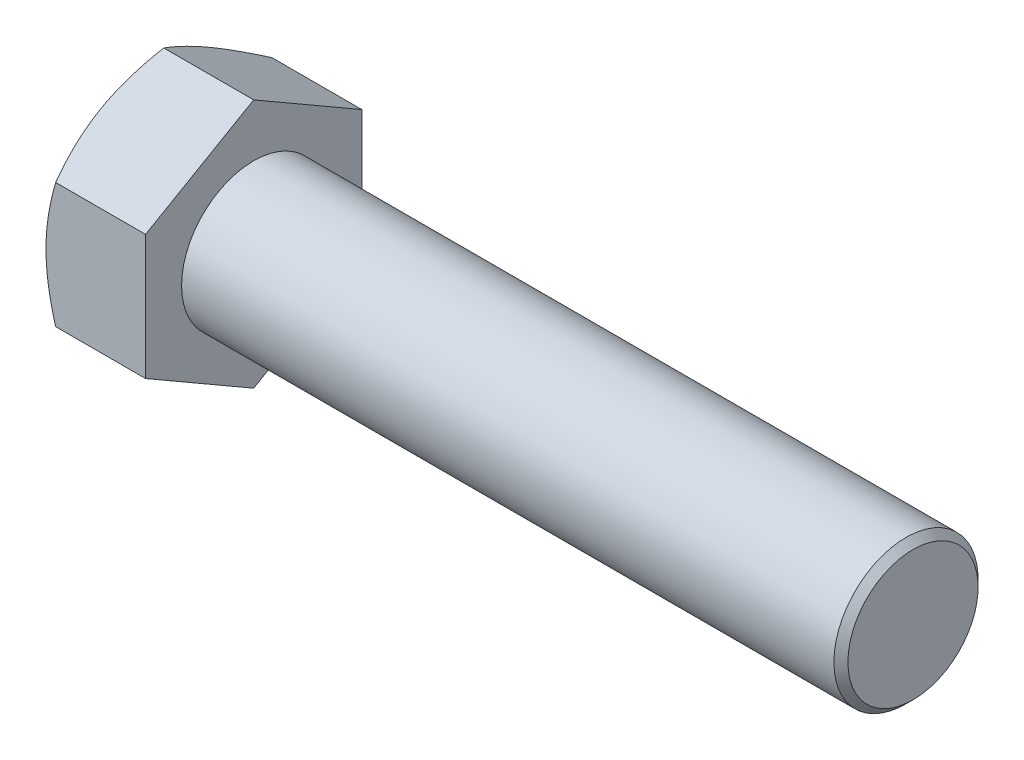
ISO-10303-21;
HEADER;
FILE_DESCRIPTION(('STEP AP214'),'2;1');
FILE_NAME('part.step','',(''),(''),'','','');
FILE_SCHEMA(('AUTOMOTIVE_DESIGN { 1 0 10303 214 1 1 1 1 }'));
ENDSEC;
DATA;
#1=APPLICATION_CONTEXT('core data for automotive mechanical design processes');
#2=APPLICATION_PROTOCOL_DEFINITION('international standard','automotive_design',2000,#1);
#3=PRODUCT_CONTEXT('',#1,'mechanical');
#4=PRODUCT('Part','Part','',(#3));
#5=PRODUCT_RELATED_PRODUCT_CATEGORY('part','',(#4));
#6=PRODUCT_DEFINITION_FORMATION('','',#4);
#7=PRODUCT_DEFINITION_CONTEXT('part definition',#1,'design');
#8=PRODUCT_DEFINITION('design','',#6,#7);
#9=PRODUCT_DEFINITION_SHAPE('','',#8);
#10=(LENGTH_UNIT() NAMED_UNIT(*) SI_UNIT(.MILLI.,.METRE.));
#11=(NAMED_UNIT(*) PLANE_ANGLE_UNIT() SI_UNIT($,.RADIAN.));
#12=(NAMED_UNIT(*) SI_UNIT($,.STERADIAN.) SOLID_ANGLE_UNIT());
#13=UNCERTAINTY_MEASURE_WITH_UNIT(LENGTH_MEASURE(1.E-05),#10,'distance_accuracy_value','');
#14=(GEOMETRIC_REPRESENTATION_CONTEXT(3) GLOBAL_UNCERTAINTY_ASSIGNED_CONTEXT((#13)) GLOBAL_UNIT_ASSIGNED_CONTEXT((#10,
#11,#12)) REPRESENTATION_CONTEXT('',''));
#15=CARTESIAN_POINT('',(0.,0.,0.));
#16=DIRECTION('',(0.,0.,1.));
#17=DIRECTION('',(1.,0.,0.));
#18=AXIS2_PLACEMENT_3D('',#15,#16,#17);
#19=CARTESIAN_POINT('',(15.3416,9.6200411253452,-16.6624));
#20=DIRECTION('',(0.,-0.866025403784438,0.500000000000001));
#21=DIRECTION('',(0.,-0.500000000000001,-0.866025403784438));
#22=AXIS2_PLACEMENT_3D('',#19,#20,#21);
#23=PLANE('',#22);
#24=CARTESIAN_POINT('',(1.48829220858826,19.2401977207443,0.0002));
#25=CARTESIAN_POINT('',(1.36622283895284,19.028753105755,-0.366032816148335));
#26=CARTESIAN_POINT('',(1.24969276885297,18.8164837432287,-0.733694136934186));
#27=CARTESIAN_POINT('',(1.02925095936762,18.3902428689637,-1.4719649874237));
#28=CARTESIAN_POINT('',(0.925343370118908,18.1762708219061,-1.84257544432685));
#29=CARTESIAN_POINT('',(0.731543249344443,17.7462110358046,-2.58746084414686));
#30=CARTESIAN_POINT('',(0.641683878998496,17.53011953331,-2.96174230555155));
#31=CARTESIAN_POINT('',(0.477909771158691,17.0964350034847,-3.71290594566557));
#32=CARTESIAN_POINT('',(0.403994120692871,16.8788420628664,-4.08978797418473));
#33=CARTESIAN_POINT('',(0.275251303949624,16.4477301357542,-4.83649573569204));
#34=CARTESIAN_POINT('',(0.219998022328901,16.2342431550296,-5.20626603306154));
#35=CARTESIAN_POINT('',(0.127350602917071,15.8062909616663,-5.94750097517717));
#36=CARTESIAN_POINT('',(0.0899568088860122,15.5918257302785,-6.31896565239784));
#37=CARTESIAN_POINT('',(0.0339725362796311,15.1625350016603,-7.06251900558288));
#38=CARTESIAN_POINT('',(0.015359713691744,14.9477102378287,-7.43460641126319));
#39=CARTESIAN_POINT('',(-0.00266233524241096,14.517862414981,-8.17912467995825));
#40=CARTESIAN_POINT('',(-0.00207215497260527,14.3028393622975,-8.55155553200468));
#41=CARTESIAN_POINT('',(0.0169707315043864,13.9008482467026,-9.24782456840632));
#42=CARTESIAN_POINT('',(0.0331013278418221,13.7138515430389,-9.57171235999976));
#43=CARTESIAN_POINT('',(0.0795799751792872,13.3403041936295,-10.2187153482096));
#44=CARTESIAN_POINT('',(0.109927822568737,13.1537535415341,-10.5418305558238));
#45=CARTESIAN_POINT('',(0.184313032891822,12.7811757068382,-11.1871542952912));
#46=CARTESIAN_POINT('',(0.228362282492748,12.5951491208412,-11.5093617937966));
#47=CARTESIAN_POINT('',(0.329377054640843,12.223968073547,-12.1522662265168));
#48=CARTESIAN_POINT('',(0.386343455127077,12.0388136724029,-12.4729630565432));
#49=CARTESIAN_POINT('',(0.578058408372527,11.4767672656835,-13.4464559891929));
#50=CARTESIAN_POINT('',(0.73192281293755,11.101502841058,-14.0964330389173));
#51=CARTESIAN_POINT('',(1.08113191708035,10.3565695898289,-15.3866952782936));
#52=CARTESIAN_POINT('',(1.27639460556248,9.98689122584505,-16.0269969871725));
#53=CARTESIAN_POINT('',(1.48829220858825,9.61992565529136,-16.6626));
#54=B_SPLINE_CURVE_WITH_KNOTS('',3,(#24,#25,#26,#27,#28,#29,#30,#31,#32,#33,#34,#35,#36,#37,#38,
#39,#40,#41,#42,#43,#44,#45,#46,#47,#48,#49,#50,#51,#52,#53),.UNSPECIFIED.,.F.,.F.,(4,2,2,2,2,2,
2,2,2,2,2,2,2,2,4),(0.,1.32049889544942,2.64143078841656,3.9654351677652,5.28936371161457,
6.58061480471232,7.87189075085528,9.16162862821639,10.4513266519669,11.5740792758741,
12.6968158209118,13.820529126906,14.9443188311466,17.2413172616423,19.5338071001136),.UNSPECIFIED.);
#55=CARTESIAN_POINT('',(1.48822554132144,19.2400822506905,0.));
#56=VERTEX_POINT('',#55);
#57=CARTESIAN_POINT('',(0.,14.4300616880178,-8.33120000000002));
#58=VERTEX_POINT('',#57);
#59=EDGE_CURVE('E59',#56,#58,#54,.T.);
#60=ORIENTED_EDGE('',*,*,#59,.F.);
#61=DIRECTION('',(-1.,0.,0.));
#62=VECTOR('',#61,1.);
#63=CARTESIAN_POINT('',(15.3416,19.2400822506904,0.));
#64=LINE('',#63,#62);
#65=CARTESIAN_POINT('',(15.3416,19.2400822506904,0.));
#66=VERTEX_POINT('',#65);
#67=EDGE_CURVE('E155',#66,#56,#64,.T.);
#68=ORIENTED_EDGE('',*,*,#67,.F.);
#69=DIRECTION('',(0.,0.500000000000001,0.866025403784438));
#70=VECTOR('',#69,1.);
#71=CARTESIAN_POINT('',(15.3416,9.6200411253452,-16.6624));
#72=LINE('',#71,#70);
#73=CARTESIAN_POINT('',(15.3416,9.6200411253452,-16.6624));
#74=VERTEX_POINT('',#73);
#75=EDGE_CURVE('E246',#74,#66,#72,.T.);
#76=ORIENTED_EDGE('',*,*,#75,.F.);
#77=DIRECTION('',(-1.,0.,0.));
#78=VECTOR('',#77,1.);
#79=CARTESIAN_POINT('',(15.3416,9.6200411253452,-16.6624));
#80=LINE('',#79,#78);
#81=CARTESIAN_POINT('',(1.48822554132143,9.6200411253452,-16.6624));
#82=VERTEX_POINT('',#81);
#83=EDGE_CURVE('E143',#74,#82,#80,.T.);
#84=ORIENTED_EDGE('',*,*,#83,.T.);
#85=EDGE_CURVE('E137',#58,#82,#54,.T.);
#86=ORIENTED_EDGE('',*,*,#85,.F.);
#87=EDGE_LOOP('',(#60,#68,#76,#84,#86));
#88=FACE_BOUND('',#87,.T.);
#89=ADVANCED_FACE('F43',(#88),#23,.F.);
#90=CARTESIAN_POINT('',(15.3416,19.2400822506904,0.));
#91=DIRECTION('',(0.,-0.866025403784438,-0.500000000000001));
#92=DIRECTION('',(0.,0.500000000000001,-0.866025403784438));
#93=AXIS2_PLACEMENT_3D('',#90,#91,#92);
#94=PLANE('',#93);
#95=CARTESIAN_POINT('',(1.48829220858825,9.61992565529137,16.6626));
#96=CARTESIAN_POINT('',(1.36622283895283,9.83137027028069,16.2963671838517));
#97=CARTESIAN_POINT('',(1.24969276885296,10.043639632807,15.9287058630658));
#98=CARTESIAN_POINT('',(1.02925095936761,10.469880507072,15.1904350125763));
#99=CARTESIAN_POINT('',(0.925343370118898,10.6838525541295,14.8198245556731));
#100=CARTESIAN_POINT('',(0.731543249344433,11.113912340231,14.0749391558531));
#101=CARTESIAN_POINT('',(0.641683878998487,11.3300038427257,13.7006576944485));
#102=CARTESIAN_POINT('',(0.477909771158685,11.763688372551,12.9494940543344));
#103=CARTESIAN_POINT('',(0.403994120692867,11.9812813131693,12.5726120258153));
#104=CARTESIAN_POINT('',(0.275251303949621,12.4123932402815,11.825904264308));
#105=CARTESIAN_POINT('',(0.219998022328899,12.6258802210061,11.4561339669385));
#106=CARTESIAN_POINT('',(0.127350602917069,13.0538324143693,10.7148990248228));
#107=CARTESIAN_POINT('',(0.0899568088860101,13.2682976457571,10.3434343476022));
#108=CARTESIAN_POINT('',(0.0339725362796294,13.6975883743753,9.59988099441713));
#109=CARTESIAN_POINT('',(0.0153597136917428,13.9124131382069,9.22779358873681));
#110=CARTESIAN_POINT('',(-0.00266233524241083,14.3422609610546,8.48327532004175));
#111=CARTESIAN_POINT('',(-0.00207215497260427,14.5572840137381,8.11084446799532));
#112=CARTESIAN_POINT('',(0.0169707315043879,14.959275129333,7.41457543159369));
#113=CARTESIAN_POINT('',(0.0331013278418235,15.1462718329967,7.09068764000024));
#114=CARTESIAN_POINT('',(0.0795799751792904,15.5198191824062,6.44368465179042));
#115=CARTESIAN_POINT('',(0.109927822568742,15.7063698345015,6.12056944417618));
#116=CARTESIAN_POINT('',(0.184313032891828,16.0789476691975,5.47524570470877));
#117=CARTESIAN_POINT('',(0.228362282492752,16.2649742551945,5.15303820620345));
#118=CARTESIAN_POINT('',(0.329377054640848,16.6361553024887,4.51013377348319));
#119=CARTESIAN_POINT('',(0.386343455127084,16.8213097036327,4.18943694345679));
#120=CARTESIAN_POINT('',(0.578058408372538,17.3833561103522,3.21594401080714));
#121=CARTESIAN_POINT('',(0.731922812937561,17.7586205349777,2.56596696108265));
#122=CARTESIAN_POINT('',(1.08113191708036,18.5035537862068,1.27570472170637));
#123=CARTESIAN_POINT('',(1.27639460556249,18.8732321501906,0.63540301282747));
#124=CARTESIAN_POINT('',(1.48829220858826,19.2401977207443,-0.000199999999999537));
#125=B_SPLINE_CURVE_WITH_KNOTS('',3,(#95,#96,#97,#98,#99,#100,#101,#102,#103,#104,#105,#106,
#107,#108,#109,#110,#111,#112,#113,#114,#115,#116,#117,#118,#119,#120,#121,#122,#123,#124),
.UNSPECIFIED.,.F.,.F.,(4,2,2,2,2,2,2,2,2,2,2,2,2,2,4),(0.,1.32049889544942,2.64143078841656,
3.9654351677652,5.28936371161457,6.58061480471231,7.87189075085527,9.16162862821638,
10.4513266519669,11.5740792758741,12.6968158209118,13.820529126906,14.9443188311466,
17.2413172616423,19.5338071001136),.UNSPECIFIED.);
#126=CARTESIAN_POINT('',(1.48822554132143,9.62004112534521,16.6624));
#127=VERTEX_POINT('',#126);
#128=CARTESIAN_POINT('',(0.,14.4300616880178,8.33120000000001));
#129=VERTEX_POINT('',#128);
#130=EDGE_CURVE('E66',#127,#129,#125,.T.);
#131=ORIENTED_EDGE('',*,*,#130,.F.);
#132=DIRECTION('',(-1.,0.,0.));
#133=VECTOR('',#132,1.);
#134=CARTESIAN_POINT('',(15.3416,9.62004112534521,16.6624));
#135=LINE('',#134,#133);
#136=CARTESIAN_POINT('',(15.3416,9.62004112534521,16.6624));
#137=VERTEX_POINT('',#136);
#138=EDGE_CURVE('E153',#137,#127,#135,.T.);
#139=ORIENTED_EDGE('',*,*,#138,.F.);
#140=DIRECTION('',(0.,-0.500000000000001,0.866025403784438));
#141=VECTOR('',#140,1.);
#142=CARTESIAN_POINT('',(15.3416,19.2400822506904,0.));
#143=LINE('',#142,#141);
#144=EDGE_CURVE('E244',#66,#137,#143,.T.);
#145=ORIENTED_EDGE('',*,*,#144,.F.);
#146=ORIENTED_EDGE('',*,*,#67,.T.);
#147=EDGE_CURVE('E170',#129,#56,#125,.T.);
#148=ORIENTED_EDGE('',*,*,#147,.F.);
#149=EDGE_LOOP('',(#131,#139,#145,#146,#148));
#150=FACE_BOUND('',#149,.T.);
#151=ADVANCED_FACE('F176',(#150),#94,.F.);
#152=CARTESIAN_POINT('',(15.3416,9.62004112534521,16.6624));
#153=DIRECTION('',(0.,0.,-1.));
#154=DIRECTION('',(0.,1.,0.));
#155=AXIS2_PLACEMENT_3D('',#152,#153,#154);
#156=PLANE('',#155);
#157=CARTESIAN_POINT('',(8.22164509272719,-26.0257896624189,16.6624));
#158=CARTESIAN_POINT('',(8.04434599439993,-25.6611463637942,16.6624));
#159=CARTESIAN_POINT('',(7.86791708374687,-25.2960801557625,16.6624));
#160=CARTESIAN_POINT('',(7.51699635306082,-24.5650137355599,16.6624));
#161=CARTESIAN_POINT('',(7.34250455194592,-24.1990135143101,16.6624));
#162=CARTESIAN_POINT('',(6.82218508705523,-23.0993846259986,16.6624));
#163=CARTESIAN_POINT('',(6.47956456555795,-22.364232758842,16.6624));
#164=CARTESIAN_POINT('',(5.80310742938759,-20.8851581863444,16.6624));
#165=CARTESIAN_POINT('',(5.46932720606579,-20.1412096294622,16.6624));
#166=CARTESIAN_POINT('',(4.81517496228219,-18.6474608856369,16.6624));
#167=CARTESIAN_POINT('',(4.49480232069081,-17.8976609716818,16.6624));
#168=CARTESIAN_POINT('',(3.86067992339217,-16.3660743997116,16.6624));
#169=CARTESIAN_POINT('',(3.54750035780181,-15.584050449172,16.6624));
#170=CARTESIAN_POINT('',(2.94439724196953,-14.0109164551487,16.6624));
#171=CARTESIAN_POINT('',(2.65447627591384,-13.2198054131605,16.6624));
#172=CARTESIAN_POINT('',(2.10537077010853,-11.6286859886654,16.6624));
#173=CARTESIAN_POINT('',(1.84612556761438,-10.8286987079723,16.6624));
#174=CARTESIAN_POINT('',(1.3665524030007,-9.21717443246324,16.6624));
#175=CARTESIAN_POINT('',(1.14621237677199,-8.40564110260778,16.6624));
#176=CARTESIAN_POINT('',(0.853369918651563,-7.1817891142791,16.6624));
#177=CARTESIAN_POINT('',(0.762237563300738,-6.77390240496468,16.6624));
#178=CARTESIAN_POINT('',(0.593594770187671,-5.95530800403371,16.6624));
#179=CARTESIAN_POINT('',(0.51608406177755,-5.54460036863451,16.6624));
#180=CARTESIAN_POINT('',(0.376040960858033,-4.72063291261086,16.6624));
#181=CARTESIAN_POINT('',(0.313508337967318,-4.30737313134183,16.6624));
#182=CARTESIAN_POINT('',(0.204662075321274,-3.47872666025358,16.6624));
#183=CARTESIAN_POINT('',(0.15834772131471,-3.06334006491674,16.6624));
#184=CARTESIAN_POINT('',(0.0834487658941515,-2.23652152670713,16.6624));
#185=CARTESIAN_POINT('',(0.0546369494069092,-1.82511029375207,16.6624));
#186=CARTESIAN_POINT('',(0.014446770887921,-1.00143821029122,16.6624));
#187=CARTESIAN_POINT('',(0.0030681144035693,-0.589177374253321,16.6624));
#188=CARTESIAN_POINT('',(-0.00198430893864704,0.235456351831487,16.6624));
#189=CARTESIAN_POINT('',(0.00434194741196159,0.647829242024569,16.6624));
#190=CARTESIAN_POINT('',(0.0345427779307335,1.47193677270388,16.6624));
#191=CARTESIAN_POINT('',(0.058418135436777,1.88367138387714,16.6624));
#192=CARTESIAN_POINT('',(0.135934690581573,2.86764639176185,16.6624));
#193=CARTESIAN_POINT('',(0.197593524997373,3.43926666294606,16.6624));
#194=CARTESIAN_POINT('',(0.3514214244265,4.57838941858348,16.6624));
#195=CARTESIAN_POINT('',(0.443594484445646,5.14589135390569,16.6624));
#196=CARTESIAN_POINT('',(0.655172226537651,6.27619412275952,16.6624));
#197=CARTESIAN_POINT('',(0.774597586970072,6.83899104835958,16.6624));
#198=CARTESIAN_POINT('',(1.03702522572261,7.95900081485822,16.6624));
#199=CARTESIAN_POINT('',(1.18002719082487,8.51621372983671,16.6624));
#200=CARTESIAN_POINT('',(1.48952817763261,9.63742193800513,16.6624));
#201=CARTESIAN_POINT('',(1.65648011639228,10.2012913331135,16.6624));
#202=CARTESIAN_POINT('',(2.00800777787534,11.3234782484586,16.6624));
#203=CARTESIAN_POINT('',(2.19258361946115,11.8817957312229,16.6624));
#204=CARTESIAN_POINT('',(2.57639583491167,12.9931482252761,16.6624));
#205=CARTESIAN_POINT('',(2.77562758915428,13.5461848395511,16.6624));
#206=CARTESIAN_POINT('',(3.18637114340819,14.6476507035618,16.6624));
#207=CARTESIAN_POINT('',(3.39788278286763,15.1960800134279,16.6624));
#208=CARTESIAN_POINT('',(3.92019877173346,16.5134270037689,16.6624));
#209=CARTESIAN_POINT('',(4.23608462611976,17.2803271386577,16.6624));
#210=CARTESIAN_POINT('',(4.88381068964253,18.8073811238195,16.6624));
#211=CARTESIAN_POINT('',(5.21565199343991,19.5675345069655,16.6624));
#212=CARTESIAN_POINT('',(5.89201922664066,21.0823871055584,16.6624));
#213=CARTESIAN_POINT('',(6.23654827876434,21.8370849228567,16.6624));
#214=CARTESIAN_POINT('',(6.93566827393983,23.3417712615155,16.6624));
#215=CARTESIAN_POINT('',(7.29025897603377,24.0917598951277,16.6624));
#216=CARTESIAN_POINT('',(8.00800184704983,25.5887104314289,16.6624));
#217=CARTESIAN_POINT('',(8.37116362235635,26.3356677197903,16.6624));
#218=CARTESIAN_POINT('',(9.10415281410865,27.8263042460643,16.6624));
#219=CARTESIAN_POINT('',(9.47398026273146,28.5699834681311,16.6624));
#220=CARTESIAN_POINT('',(10.2190827077366,30.0544746991066,16.6624));
#221=CARTESIAN_POINT('',(10.5943569349586,30.7952870944922,16.6624));
#222=CARTESIAN_POINT('',(11.3494923878504,32.2745659615686,16.6624));
#223=CARTESIAN_POINT('',(11.7293536040817,33.0130324380826,16.6624));
#224=CARTESIAN_POINT('',(12.808308339535,35.0972033721326,16.6624));
#225=CARTESIAN_POINT('',(13.5118862286309,36.4405862009893,16.6624));
#226=CARTESIAN_POINT('',(14.9285753043895,39.1223708046942,16.6624));
#227=CARTESIAN_POINT('',(15.6416868636698,40.4607723822242,16.6624));
#228=CARTESIAN_POINT('',(17.0732765934307,43.1301244334298,16.6624));
#229=CARTESIAN_POINT('',(17.7917354812495,44.4610852556436,16.6624));
#230=CARTESIAN_POINT('',(18.8736349552661,46.4551885082581,16.6624));
#231=CARTESIAN_POINT('',(19.2349594482728,47.1194807302153,16.6624));
#232=CARTESIAN_POINT('',(19.9588707067244,48.4473757738426,16.6624));
#233=CARTESIAN_POINT('',(20.3214574702282,49.1109785965709,16.6624));
#234=CARTESIAN_POINT('',(20.6846018054718,49.774276245195,16.6624));
#235=B_SPLINE_CURVE_WITH_KNOTS('',3,(#157,#158,#159,#160,#161,#162,#163,#164,#165,#166,#167,
#168,#169,#170,#171,#172,#173,#174,#175,#176,#177,#178,#179,#180,#181,#182,#183,#184,#185,#186,
#187,#188,#189,#190,#191,#192,#193,#194,#195,#196,#197,#198,#199,#200,#201,#202,#203,#204,#205,
#206,#207,#208,#209,#210,#211,#212,#213,#214,#215,#216,#217,#218,#219,#220,#221,#222,#223,#224,
#225,#226,#227,#228,#229,#230,#231,#232,#233,#234),.UNSPECIFIED.,.F.,.F.,(4,2,2,2,2,2,2,2,2,2,2,
2,2,2,2,2,2,2,2,2,2,2,2,2,2,2,2,2,2,2,2,2,2,2,2,2,2,2,4),(0.,1.21638486168481,2.43278159231982,
4.86592555926723,7.31200680114574,9.75797459832355,12.2849012160502,14.8121082045311,
17.3342309058074,19.8555701430835,21.1092096632871,22.3628242721677,23.6164195976801,
24.8699597080115,26.1068579806328,27.3437353613484,28.5806143634246,29.8175485793269,
31.5414072390945,33.2654916804638,34.9908886894104,36.7162627781094,38.4801173592769,
40.2439838374031,42.0072966982238,43.7705865100158,46.2585657607352,48.746715949334,
51.2354826710945,53.7241898417222,56.2158329089621,58.7074880072675,61.1987946082146,
63.690096083707,68.2394656472463,72.7890135429844,77.326478627777,79.5950798125587,
81.8636775100378),.UNSPECIFIED.);
#236=CARTESIAN_POINT('',(1.48822554132143,-9.62004112534518,16.6624));
#237=VERTEX_POINT('',#236);
#238=CARTESIAN_POINT('',(0.,0.,16.6624));
#239=VERTEX_POINT('',#238);
#240=EDGE_CURVE('E256',#237,#239,#235,.T.);
#241=ORIENTED_EDGE('',*,*,#240,.F.);
#242=DIRECTION('',(-1.,0.,0.));
#243=VECTOR('',#242,1.);
#244=CARTESIAN_POINT('',(15.3416,-9.62004112534518,16.6624));
#245=LINE('',#244,#243);
#246=CARTESIAN_POINT('',(15.3416,-9.62004112534518,16.6624));
#247=VERTEX_POINT('',#246);
#248=EDGE_CURVE('E145',#247,#237,#245,.T.);
#249=ORIENTED_EDGE('',*,*,#248,.F.);
#250=DIRECTION('',(0.,-1.,0.));
#251=VECTOR('',#250,1.);
#252=CARTESIAN_POINT('',(15.3416,9.62004112534521,16.6624));
#253=LINE('',#252,#251);
#254=EDGE_CURVE('E240',#137,#247,#253,.T.);
#255=ORIENTED_EDGE('',*,*,#254,.F.);
#256=ORIENTED_EDGE('',*,*,#138,.T.);
#257=EDGE_CURVE('E194',#239,#127,#235,.T.);
#258=ORIENTED_EDGE('',*,*,#257,.F.);
#259=EDGE_LOOP('',(#241,#249,#255,#256,#258));
#260=FACE_BOUND('',#259,.T.);
#261=ADVANCED_FACE('F262',(#260),#156,.F.);
#262=CARTESIAN_POINT('',(15.3416,-19.2400822506905,0.));
#263=DIRECTION('',(0.,0.866025403784437,-0.500000000000002));
#264=DIRECTION('',(0.,0.500000000000002,0.866025403784438));
#265=AXIS2_PLACEMENT_3D('',#262,#263,#264);
#266=PLANE('',#265);
#267=CARTESIAN_POINT('',(1.48829220858826,-19.2401977207443,-0.000200000000000009));
#268=CARTESIAN_POINT('',(1.36622283895284,-19.028753105755,0.366032816148333));
#269=CARTESIAN_POINT('',(1.24969276885297,-18.8164837432286,0.733694136934185));
#270=CARTESIAN_POINT('',(1.02925095936762,-18.3902428689637,1.4719649874237));
#271=CARTESIAN_POINT('',(0.925343370118908,-18.1762708219061,1.84257544432685));
#272=CARTESIAN_POINT('',(0.731543249344442,-17.7462110358046,2.58746084414686));
#273=CARTESIAN_POINT('',(0.641683878998494,-17.53011953331,2.96174230555155));
#274=CARTESIAN_POINT('',(0.477909771158689,-17.0964350034847,3.71290594566557));
#275=CARTESIAN_POINT('',(0.403994120692869,-16.8788420628664,4.08978797418473));
#276=CARTESIAN_POINT('',(0.275251303949622,-16.4477301357542,4.83649573569204));
#277=CARTESIAN_POINT('',(0.2199980223289,-16.2342431550295,5.20626603306154));
#278=CARTESIAN_POINT('',(0.127350602917068,-15.8062909616663,5.94750097517716));
#279=CARTESIAN_POINT('',(0.089956808886007,-15.5918257302785,6.31896565239784));
#280=CARTESIAN_POINT('',(0.0339725362796259,-15.1625350016603,7.06251900558287));
#281=CARTESIAN_POINT('',(0.0153597136917407,-14.9477102378287,7.43460641126319));
#282=CARTESIAN_POINT('',(-0.00266233524241367,-14.517862414981,8.17912467995825));
#283=CARTESIAN_POINT('',(-0.00207215497260927,-14.3028393622975,8.55155553200468));
#284=CARTESIAN_POINT('',(0.0169707315043815,-13.9008482467026,9.24782456840631));
#285=CARTESIAN_POINT('',(0.0331013278418175,-13.7138515430389,9.57171235999976));
#286=CARTESIAN_POINT('',(0.0795799751792838,-13.3403041936295,10.2187153482096));
#287=CARTESIAN_POINT('',(0.109927822568734,-13.1537535415341,10.5418305558238));
#288=CARTESIAN_POINT('',(0.184313032891818,-12.7811757068382,11.1871542952912));
#289=CARTESIAN_POINT('',(0.22836228249274,-12.5951491208412,11.5093617937965));
#290=CARTESIAN_POINT('',(0.329377054640836,-12.2239680735469,12.1522662265168));
#291=CARTESIAN_POINT('',(0.386343455127072,-12.0388136724029,12.4729630565432));
#292=CARTESIAN_POINT('',(0.578058408372526,-11.4767672656835,13.4464559891929));
#293=CARTESIAN_POINT('',(0.731922812937548,-11.1015028410579,14.0964330389174));
#294=CARTESIAN_POINT('',(1.08113191708034,-10.3565695898288,15.3866952782936));
#295=CARTESIAN_POINT('',(1.27639460556247,-9.98689122584503,16.0269969871725));
#296=CARTESIAN_POINT('',(1.48829220858824,-9.61992565529135,16.6626));
#297=B_SPLINE_CURVE_WITH_KNOTS('',3,(#267,#268,#269,#270,#271,#272,#273,#274,#275,#276,#277,
#278,#279,#280,#281,#282,#283,#284,#285,#286,#287,#288,#289,#290,#291,#292,#293,#294,#295,#296),
.UNSPECIFIED.,.F.,.F.,(4,2,2,2,2,2,2,2,2,2,2,2,2,2,4),(0.,1.32049889544943,2.64143078841656,
3.9654351677652,5.28936371161457,6.58061480471232,7.87189075085528,9.16162862821639,
10.4513266519669,11.5740792758741,12.6968158209118,13.820529126906,14.9443188311467,
17.2413172616423,19.5338071001136),.UNSPECIFIED.);
#298=CARTESIAN_POINT('',(1.48822554132144,-19.2400822506905,0.));
#299=VERTEX_POINT('',#298);
#300=CARTESIAN_POINT('',(0.,-14.4300616880178,8.33120000000003));
#301=VERTEX_POINT('',#300);
#302=EDGE_CURVE('E178',#299,#301,#297,.T.);
#303=ORIENTED_EDGE('',*,*,#302,.F.);
#304=DIRECTION('',(-1.,0.,0.));
#305=VECTOR('',#304,1.);
#306=CARTESIAN_POINT('',(15.3416,-19.2400822506905,0.));
#307=LINE('',#306,#305);
#308=CARTESIAN_POINT('',(15.3416,-19.2400822506905,0.));
#309=VERTEX_POINT('',#308);
#310=EDGE_CURVE('E142',#309,#299,#307,.T.);
#311=ORIENTED_EDGE('',*,*,#310,.F.);
#312=DIRECTION('',(0.,-0.500000000000002,-0.866025403784437));
#313=VECTOR('',#312,1.);
#314=CARTESIAN_POINT('',(15.3416,-19.2400822506905,0.));
#315=LINE('',#314,#313);
#316=EDGE_CURVE('E238',#247,#309,#315,.T.);
#317=ORIENTED_EDGE('',*,*,#316,.F.);
#318=ORIENTED_EDGE('',*,*,#248,.T.);
#319=EDGE_CURVE('E180',#301,#237,#297,.T.);
#320=ORIENTED_EDGE('',*,*,#319,.F.);
#321=EDGE_LOOP('',(#303,#311,#317,#318,#320));
#322=FACE_BOUND('',#321,.T.);
#323=ADVANCED_FACE('F234',(#322),#266,.F.);
#324=CARTESIAN_POINT('',(15.3416,-9.62004112534524,-16.6624));
#325=DIRECTION('',(0.,0.866025403784439,0.5));
#326=DIRECTION('',(0.,-0.5,0.866025403784439));
#327=AXIS2_PLACEMENT_3D('',#324,#325,#326);
#328=PLANE('',#327);
#329=CARTESIAN_POINT('',(1.48829220858826,-9.6199256552914,-16.6626));
#330=CARTESIAN_POINT('',(1.36622283895284,-9.83137027028072,-16.2963671838517));
#331=CARTESIAN_POINT('',(1.24969276885297,-10.043639632807,-15.9287058630658));
#332=CARTESIAN_POINT('',(1.02925095936762,-10.469880507072,-15.1904350125763));
#333=CARTESIAN_POINT('',(0.925343370118908,-10.6838525541295,-14.8198245556731));
#334=CARTESIAN_POINT('',(0.731543249344443,-11.113912340231,-14.0749391558531));
#335=CARTESIAN_POINT('',(0.641683878998498,-11.3300038427257,-13.7006576944484));
#336=CARTESIAN_POINT('',(0.477909771158694,-11.763688372551,-12.9494940543344));
#337=CARTESIAN_POINT('',(0.403994120692875,-11.9812813131693,-12.5726120258153));
#338=CARTESIAN_POINT('',(0.275251303949629,-12.4123932402815,-11.825904264308));
#339=CARTESIAN_POINT('',(0.219998022328908,-12.6258802210061,-11.4561339669385));
#340=CARTESIAN_POINT('',(0.127350602917079,-13.0538324143693,-10.7148990248228));
#341=CARTESIAN_POINT('',(0.0899568088860189,-13.2682976457571,-10.3434343476021));
#342=CARTESIAN_POINT('',(0.0339725362796381,-13.6975883743754,-9.59988099441712));
#343=CARTESIAN_POINT('',(0.015359713691752,-13.912413138207,-9.2277935887368));
#344=CARTESIAN_POINT('',(-0.00266233524240056,-14.3422609610546,-8.48327532004175));
#345=CARTESIAN_POINT('',(-0.00207215497259354,-14.5572840137382,-8.11084446799531));
#346=CARTESIAN_POINT('',(0.0169707315043987,-14.9592751293331,-7.41457543159368));
#347=CARTESIAN_POINT('',(0.0331013278418337,-15.1462718329968,-7.09068764000023));
#348=CARTESIAN_POINT('',(0.0795799751792996,-15.5198191824062,-6.44368465179041));
#349=CARTESIAN_POINT('',(0.109927822568751,-15.7063698345015,-6.12056944417617));
#350=CARTESIAN_POINT('',(0.184313032891836,-16.0789476691975,-5.47524570470876));
#351=CARTESIAN_POINT('',(0.228362282492761,-16.2649742551945,-5.15303820620345));
#352=CARTESIAN_POINT('',(0.329377054640856,-16.6361553024887,-4.51013377348319));
#353=CARTESIAN_POINT('',(0.386343455127091,-16.8213097036327,-4.18943694345679));
#354=CARTESIAN_POINT('',(0.578058408372542,-17.3833561103522,-3.21594401080713));
#355=CARTESIAN_POINT('',(0.731922812937564,-17.7586205349777,-2.56596696108265));
#356=CARTESIAN_POINT('',(1.08113191708036,-18.5035537862068,-1.27570472170637));
#357=CARTESIAN_POINT('',(1.27639460556249,-18.8732321501906,-0.635403012827473));
#358=CARTESIAN_POINT('',(1.48829220858826,-19.2401977207443,0.000199999999998978));
#359=B_SPLINE_CURVE_WITH_KNOTS('',3,(#329,#330,#331,#332,#333,#334,#335,#336,#337,#338,#339,
#340,#341,#342,#343,#344,#345,#346,#347,#348,#349,#350,#351,#352,#353,#354,#355,#356,#357,#358),
.UNSPECIFIED.,.F.,.F.,(4,2,2,2,2,2,2,2,2,2,2,2,2,2,4),(0.,1.32049889544942,2.64143078841656,
3.9654351677652,5.28936371161457,6.58061480471232,7.87189075085528,9.16162862821639,
10.4513266519669,11.5740792758741,12.6968158209118,13.820529126906,14.9443188311466,
17.2413172616423,19.5338071001135),.UNSPECIFIED.);
#360=CARTESIAN_POINT('',(1.48822554132144,-9.62004112534524,-16.6624));
#361=VERTEX_POINT('',#360);
#362=CARTESIAN_POINT('',(0.,-14.4300616880178,-8.3312));
#363=VERTEX_POINT('',#362);
#364=EDGE_CURVE('E119',#361,#363,#359,.T.);
#365=ORIENTED_EDGE('',*,*,#364,.F.);
#366=DIRECTION('',(-1.,0.,0.));
#367=VECTOR('',#366,1.);
#368=CARTESIAN_POINT('',(15.3416,-9.62004112534524,-16.6624));
#369=LINE('',#368,#367);
#370=CARTESIAN_POINT('',(15.3416,-9.62004112534524,-16.6624));
#371=VERTEX_POINT('',#370);
#372=EDGE_CURVE('E133',#371,#361,#369,.T.);
#373=ORIENTED_EDGE('',*,*,#372,.F.);
#374=DIRECTION('',(0.,0.5,-0.866025403784439));
#375=VECTOR('',#374,1.);
#376=CARTESIAN_POINT('',(15.3416,-9.62004112534524,-16.6624));
#377=LINE('',#376,#375);
#378=EDGE_CURVE('E236',#309,#371,#377,.T.);
#379=ORIENTED_EDGE('',*,*,#378,.F.);
#380=ORIENTED_EDGE('',*,*,#310,.T.);
#381=EDGE_CURVE('E136',#363,#299,#359,.T.);
#382=ORIENTED_EDGE('',*,*,#381,.F.);
#383=EDGE_LOOP('',(#365,#373,#379,#380,#382));
#384=FACE_BOUND('',#383,.T.);
#385=ADVANCED_FACE('F131',(#384),#328,.F.);
#386=CARTESIAN_POINT('',(15.3416,9.6200411253452,-16.6624));
#387=DIRECTION('',(0.,0.,1.));
#388=DIRECTION('',(1.,0.,0.));
#389=AXIS2_PLACEMENT_3D('',#386,#387,#388);
#390=PLANE('',#389);
#391=CARTESIAN_POINT('',(8.22164509094724,-26.0257896587582,-16.6624));
#392=CARTESIAN_POINT('',(8.04434599265714,-25.661146360195,-16.6624));
#393=CARTESIAN_POINT('',(7.86791708204122,-25.2960801522249,-16.6624));
#394=CARTESIAN_POINT('',(7.51699635142941,-24.5650137321454,-16.6624));
#395=CARTESIAN_POINT('',(7.34250455035159,-24.1990135109573,-16.6624));
#396=CARTESIAN_POINT('',(6.82218508557203,-23.0993846228308,-16.6624));
#397=CARTESIAN_POINT('',(6.47956456414866,-22.3642327557977,-16.6624));
#398=CARTESIAN_POINT('',(5.80310742812618,-20.885158183549,-16.6624));
#399=CARTESIAN_POINT('',(5.46932720487833,-20.1412096267923,-16.6624));
#400=CARTESIAN_POINT('',(4.81517496124141,-18.6474608832187,-16.6624));
#401=CARTESIAN_POINT('',(4.49480231972276,-17.8976609693899,-16.6624));
#402=CARTESIAN_POINT('',(3.86067992257164,-16.366074397682,-16.6624));
#403=CARTESIAN_POINT('',(3.5475003570559,-15.5840504472786,-16.6624));
#404=CARTESIAN_POINT('',(2.94439724136888,-14.0109164535298,-16.6624));
#405=CARTESIAN_POINT('',(2.65447627538381,-13.2198054116799,-16.6624));
#406=CARTESIAN_POINT('',(2.10537076971297,-11.628685987464,-16.6624));
#407=CARTESIAN_POINT('',(1.84612556728268,-10.8286987069119,-16.6624));
#408=CARTESIAN_POINT('',(1.36655240278625,-9.21717443168849,-16.6624));
#409=CARTESIAN_POINT('',(1.14621237661094,-8.40564110197782,-16.6624));
#410=CARTESIAN_POINT('',(0.853369918567086,-7.18178911390465,-16.6624));
#411=CARTESIAN_POINT('',(0.762237563244323,-6.77390240469954,-16.6624));
#412=CARTESIAN_POINT('',(0.593594770180201,-5.95530800398873,-16.6624));
#413=CARTESIAN_POINT('',(0.516084061790962,-5.5446003687004,-16.6624));
#414=CARTESIAN_POINT('',(0.376040960904912,-4.72063291289968,-16.6624));
#415=CARTESIAN_POINT('',(0.313508338026786,-4.30737313174272,-16.6624));
#416=CARTESIAN_POINT('',(0.204662075396694,-3.47872666087956,-16.6624));
#417=CARTESIAN_POINT('',(0.158347721393493,-3.06334006565574,-16.6624));
#418=CARTESIAN_POINT('',(0.0834487659696774,-2.2365215276698,-16.6624));
#419=CARTESIAN_POINT('',(0.0546369494759969,-1.82511029482539,-16.6624));
#420=CARTESIAN_POINT('',(0.0144467709343694,-1.0014382115856,-16.6624));
#421=CARTESIAN_POINT('',(0.00306811443381682,-0.589177375658113,-16.6624));
#422=CARTESIAN_POINT('',(-0.00198430895032664,0.235456350206689,-16.6624));
#423=CARTESIAN_POINT('',(0.00434194737455352,0.647829240290181,-16.6624));
#424=CARTESIAN_POINT('',(0.0345427778330301,1.47193677075176,-16.6624));
#425=CARTESIAN_POINT('',(0.0584181353045064,1.88367138181689,-16.6624));
#426=CARTESIAN_POINT('',(0.135934690364261,2.86764638953399,-16.6624));
#427=CARTESIAN_POINT('',(0.197593524731056,3.43926666065923,-16.6624));
#428=CARTESIAN_POINT('',(0.351421424059569,4.57838941618137,-16.6624));
#429=CARTESIAN_POINT('',(0.443594484027105,5.14589135144725,-16.6624));
#430=CARTESIAN_POINT('',(0.655172226015074,6.27619412019051,-16.6624));
#431=CARTESIAN_POINT('',(0.774597586395065,6.83899104573631,-16.6624));
#432=CARTESIAN_POINT('',(1.03702522504325,7.95900081212802,-16.6624));
#433=CARTESIAN_POINT('',(1.18002719009358,8.51621372705384,-16.6624));
#434=CARTESIAN_POINT('',(1.48952817679722,9.63742193511547,-16.6624));
#435=CARTESIAN_POINT('',(1.6564801155047,10.2012913301698,-16.6624));
#436=CARTESIAN_POINT('',(2.00800777688498,11.3234782454073,-16.6624));
#437=CARTESIAN_POINT('',(2.19258361842021,11.8817957281182,-16.6624));
#438=CARTESIAN_POINT('',(2.57639583377134,12.9931482220648,-16.6624));
#439=CARTESIAN_POINT('',(2.77562758796514,13.5461848362867,-16.6624));
#440=CARTESIAN_POINT('',(3.18637114212312,14.6476507001912,-16.6624));
#441=CARTESIAN_POINT('',(3.39788278153543,15.1960800100042,-16.6624));
#442=CARTESIAN_POINT('',(3.92019877032617,16.5134270003096,-16.6624));
#443=CARTESIAN_POINT('',(4.23608462468774,17.2803271352148,-16.6624));
#444=CARTESIAN_POINT('',(4.883810688167,18.8073811204076,-16.6624));
#445=CARTESIAN_POINT('',(5.21565199194562,19.5675345035681,-16.6624));
#446=CARTESIAN_POINT('',(5.8920192251134,21.0823871021885,-16.6624));
#447=CARTESIAN_POINT('',(6.23654827722288,21.8370849194998,-16.6624));
#448=CARTESIAN_POINT('',(6.93566827237335,23.3417712581832,-16.6624));
#449=CARTESIAN_POINT('',(7.29025897445648,24.0917598918071,-16.6624));
#450=CARTESIAN_POINT('',(8.0080018454538,25.5887104281311,-16.6624));
#451=CARTESIAN_POINT('',(8.37116362075237,26.3356677165036,-16.6624));
#452=CARTESIAN_POINT('',(9.10415281249082,27.826304242799,-16.6624));
#453=CARTESIAN_POINT('',(9.47398026110772,28.569983464876,-16.6624));
#454=CARTESIAN_POINT('',(10.2190827061026,30.0544746958712,-16.6624));
#455=CARTESIAN_POINT('',(10.5943569333202,30.7952870912662,-16.6624));
#456=CARTESIAN_POINT('',(11.3494923862046,32.2745659583608,-16.6624));
#457=CARTESIAN_POINT('',(11.7293536024328,33.0130324348837,-16.6624));
#458=CARTESIAN_POINT('',(12.8083083378722,35.0972033689455,-16.6624));
#459=CARTESIAN_POINT('',(13.5118862269584,36.4405861978048,-16.6624));
#460=CARTESIAN_POINT('',(14.9285753026996,39.1223708015137,-16.6624));
#461=CARTESIAN_POINT('',(15.6416868619724,40.4607723790453,-16.6624));
#462=CARTESIAN_POINT('',(17.0732765917184,43.1301244302509,-16.6624));
#463=CARTESIAN_POINT('',(17.7917354795299,44.4610852524633,-16.6624));
#464=CARTESIAN_POINT('',(18.8736349535363,46.455188505075,-16.6624));
#465=CARTESIAN_POINT('',(19.2349594465396,47.1194807270313,-16.6624));
#466=CARTESIAN_POINT('',(19.9588707049849,48.4473757706565,-16.6624));
#467=CARTESIAN_POINT('',(20.3214574684856,49.1109785933837,-16.6624));
#468=CARTESIAN_POINT('',(20.6846018037263,49.7742762420067,-16.6624));
#469=B_SPLINE_CURVE_WITH_KNOTS('',3,(#391,#392,#393,#394,#395,#396,#397,#398,#399,#400,#401,
#402,#403,#404,#405,#406,#407,#408,#409,#410,#411,#412,#413,#414,#415,#416,#417,#418,#419,#420,
#421,#422,#423,#424,#425,#426,#427,#428,#429,#430,#431,#432,#433,#434,#435,#436,#437,#438,#439,
#440,#441,#442,#443,#444,#445,#446,#447,#448,#449,#450,#451,#452,#453,#454,#455,#456,#457,#458,
#459,#460,#461,#462,#463,#464,#465,#466,#467,#468),.UNSPECIFIED.,.F.,.F.,(4,2,2,2,2,2,2,2,2,2,2,
2,2,2,2,2,2,2,2,2,2,2,2,2,2,2,2,2,2,2,2,2,2,2,2,2,2,2,4),(0.,1.21638486147008,2.43278159189035,
4.86592555840824,7.3120067998526,9.75797459659629,12.2849012138606,14.812108201879,
17.3342309026943,19.8555701395098,21.1092096593752,22.3628242679176,23.6164195930922,
24.8699597030858,26.1068579753776,27.3437353557637,28.5806143575103,29.817548573083,
31.5414072326591,33.2654916738368,34.9908886825915,36.7162627710986,38.4801173520661,
40.2439838299922,42.0072966906133,43.7705865022058,46.2585657529424,48.7467159415585,
51.2354826633367,53.7241898339821,56.2158329012416,58.7074879995665,61.198794600533,
63.6900960760447,68.2394656395771,72.7890135353085,77.3264786200868,79.5950798048612,
81.8636775023331),.UNSPECIFIED.);
#470=CARTESIAN_POINT('',(0.,0.,-16.6624));
#471=VERTEX_POINT('',#470);
#472=EDGE_CURVE('E125',#82,#471,#469,.F.);
#473=ORIENTED_EDGE('',*,*,#472,.F.);
#474=ORIENTED_EDGE('',*,*,#83,.F.);
#475=DIRECTION('',(0.,1.,0.));
#476=VECTOR('',#475,1.);
#477=CARTESIAN_POINT('',(15.3416,9.6200411253452,-16.6624));
#478=LINE('',#477,#476);
#479=EDGE_CURVE('E141',#371,#74,#478,.T.);
#480=ORIENTED_EDGE('',*,*,#479,.F.);
#481=ORIENTED_EDGE('',*,*,#372,.T.);
#482=EDGE_CURVE('E116',#471,#361,#469,.F.);
#483=ORIENTED_EDGE('',*,*,#482,.F.);
#484=EDGE_LOOP('',(#473,#474,#480,#481,#483));
#485=FACE_BOUND('',#484,.T.);
#486=ADVANCED_FACE('F139',(#485),#390,.F.);
#487=CARTESIAN_POINT('',(15.3416,19.2400822506904,0.));
#488=DIRECTION('',(1.,0.,0.));
#489=DIRECTION('',(0.,0.,-1.));
#490=AXIS2_PLACEMENT_3D('',#487,#488,#489);
#491=PLANE('',#490);
#492=CARTESIAN_POINT('',(15.3416,0.,0.));
#493=DIRECTION('',(1.,0.,0.));
#494=DIRECTION('',(0.,0.,-1.));
#495=AXIS2_PLACEMENT_3D('',#492,#493,#494);
#496=CIRCLE('',#495,11.1125);
#497=CARTESIAN_POINT('',(15.3416,0.,-11.1125));
#498=VERTEX_POINT('',#497);
#499=EDGE_CURVE('E249',#498,#498,#496,.F.);
#500=ORIENTED_EDGE('',*,*,#499,.T.);
#501=EDGE_LOOP('',(#500));
#502=FACE_BOUND('',#501,.T.);
#503=ORIENTED_EDGE('',*,*,#75,.T.);
#504=ORIENTED_EDGE('',*,*,#144,.T.);
#505=ORIENTED_EDGE('',*,*,#254,.T.);
#506=ORIENTED_EDGE('',*,*,#316,.T.);
#507=ORIENTED_EDGE('',*,*,#378,.T.);
#508=ORIENTED_EDGE('',*,*,#479,.T.);
#509=EDGE_LOOP('',(#503,#504,#505,#506,#507,#508));
#510=FACE_BOUND('',#509,.T.);
#511=ADVANCED_FACE('F264',(#502,#510),#491,.T.);
#512=CARTESIAN_POINT('',(0.,0.,0.));
#513=DIRECTION('',(-1.,0.,0.));
#514=DIRECTION('',(0.,0.,1.));
#515=AXIS2_PLACEMENT_3D('',#512,#513,#514);
#516=CYLINDRICAL_SURFACE('',#515,11.1125);
#517=ORIENTED_EDGE('',*,*,#499,.F.);
#518=EDGE_LOOP('',(#517));
#519=FACE_BOUND('',#518,.T.);
#520=CARTESIAN_POINT('',(115.8621,0.,0.));
#521=DIRECTION('',(-1.,0.,0.));
#522=DIRECTION('',(0.,0.,1.));
#523=AXIS2_PLACEMENT_3D('',#520,#521,#522);
#524=CIRCLE('',#523,11.1125);
#525=CARTESIAN_POINT('',(115.8621,0.,11.1125));
#526=VERTEX_POINT('',#525);
#527=EDGE_CURVE('E252',#526,#526,#524,.T.);
#528=ORIENTED_EDGE('',*,*,#527,.T.);
#529=EDGE_LOOP('',(#528));
#530=FACE_BOUND('',#529,.T.);
#531=ADVANCED_FACE('F295',(#519,#530),#516,.T.);
#532=CARTESIAN_POINT('',(116.9416,0.,0.));
#533=DIRECTION('',(-1.,0.,0.));
#534=DIRECTION('',(0.,0.,1.));
#535=AXIS2_PLACEMENT_3D('',#532,#533,#534);
#536=CONICAL_SURFACE('',#535,10.033,0.785398163397444);
#537=ORIENTED_EDGE('',*,*,#527,.F.);
#538=EDGE_LOOP('',(#537));
#539=FACE_BOUND('',#538,.T.);
#540=CARTESIAN_POINT('',(116.9416,0.,0.));
#541=DIRECTION('',(-1.,0.,0.));
#542=DIRECTION('',(0.,0.,1.));
#543=AXIS2_PLACEMENT_3D('',#540,#541,#542);
#544=CIRCLE('',#543,10.033);
#545=CARTESIAN_POINT('',(116.9416,0.,10.033));
#546=VERTEX_POINT('',#545);
#547=EDGE_CURVE('E254',#546,#546,#544,.T.);
#548=ORIENTED_EDGE('',*,*,#547,.T.);
#549=EDGE_LOOP('',(#548));
#550=FACE_BOUND('',#549,.T.);
#551=ADVANCED_FACE('F298',(#539,#550),#536,.T.);
#552=CARTESIAN_POINT('',(116.9416,0.,0.));
#553=DIRECTION('',(-1.,0.,0.));
#554=DIRECTION('',(0.,0.,1.));
#555=AXIS2_PLACEMENT_3D('',#552,#553,#554);
#556=PLANE('',#555);
#557=ORIENTED_EDGE('',*,*,#547,.F.);
#558=EDGE_LOOP('',(#557));
#559=FACE_BOUND('',#558,.T.);
#560=ADVANCED_FACE('F208',(#559),#556,.F.);
#561=CARTESIAN_POINT('',(0.,0.,0.));
#562=DIRECTION('',(1.,0.,0.));
#563=DIRECTION('',(0.,0.,-1.));
#564=AXIS2_PLACEMENT_3D('',#561,#562,#563);
#565=CONICAL_SURFACE('',#564,16.6624,1.0471975511966);
#566=ORIENTED_EDGE('',*,*,#364,.T.);
#567=CARTESIAN_POINT('',(0.,0.,0.));
#568=DIRECTION('',(1.,0.,0.));
#569=DIRECTION('',(0.,0.,-1.));
#570=AXIS2_PLACEMENT_3D('',#567,#568,#569);
#571=CIRCLE('',#570,16.6624);
#572=EDGE_CURVE('E47',#363,#471,#571,.T.);
#573=ORIENTED_EDGE('',*,*,#572,.T.);
#574=ORIENTED_EDGE('',*,*,#482,.T.);
#575=EDGE_LOOP('',(#566,#573,#574));
#576=FACE_BOUND('',#575,.T.);
#577=ADVANCED_FACE('F118',(#576),#565,.T.);
#578=ORIENTED_EDGE('',*,*,#302,.T.);
#579=EDGE_CURVE('E160',#301,#363,#571,.T.);
#580=ORIENTED_EDGE('',*,*,#579,.T.);
#581=ORIENTED_EDGE('',*,*,#381,.T.);
#582=EDGE_LOOP('',(#578,#580,#581));
#583=FACE_BOUND('',#582,.T.);
#584=ADVANCED_FACE('F207',(#583),#565,.T.);
#585=ORIENTED_EDGE('',*,*,#240,.T.);
#586=EDGE_CURVE('E161',#239,#301,#571,.T.);
#587=ORIENTED_EDGE('',*,*,#586,.T.);
#588=ORIENTED_EDGE('',*,*,#319,.T.);
#589=EDGE_LOOP('',(#585,#587,#588));
#590=FACE_BOUND('',#589,.T.);
#591=ADVANCED_FACE('F202',(#590),#565,.T.);
#592=ORIENTED_EDGE('',*,*,#257,.T.);
#593=ORIENTED_EDGE('',*,*,#130,.T.);
#594=CARTESIAN_POINT('',(0.,0.,0.));
#595=DIRECTION('',(-1.,0.,0.));
#596=DIRECTION('',(0.,0.,1.));
#597=AXIS2_PLACEMENT_3D('',#594,#595,#596);
#598=CIRCLE('',#597,16.6624);
#599=EDGE_CURVE('E126',#239,#129,#598,.T.);
#600=ORIENTED_EDGE('',*,*,#599,.F.);
#601=EDGE_LOOP('',(#592,#593,#600));
#602=FACE_BOUND('',#601,.T.);
#603=ADVANCED_FACE('F206',(#602),#565,.T.);
#604=ORIENTED_EDGE('',*,*,#147,.T.);
#605=ORIENTED_EDGE('',*,*,#59,.T.);
#606=EDGE_CURVE('E52',#58,#129,#571,.T.);
#607=ORIENTED_EDGE('',*,*,#606,.T.);
#608=EDGE_LOOP('',(#604,#605,#607));
#609=FACE_BOUND('',#608,.T.);
#610=ADVANCED_FACE('F169',(#609),#565,.T.);
#611=ORIENTED_EDGE('',*,*,#85,.T.);
#612=ORIENTED_EDGE('',*,*,#472,.T.);
#613=EDGE_CURVE('E11',#471,#58,#571,.T.);
#614=ORIENTED_EDGE('',*,*,#613,.T.);
#615=EDGE_LOOP('',(#611,#612,#614));
#616=FACE_BOUND('',#615,.T.);
#617=ADVANCED_FACE('F267',(#616),#565,.T.);
#618=CARTESIAN_POINT('',(0.,19.2400822506904,0.));
#619=DIRECTION('',(1.,0.,0.));
#620=DIRECTION('',(0.,0.,-1.));
#621=AXIS2_PLACEMENT_3D('',#618,#619,#620);
#622=PLANE('',#621);
#623=ORIENTED_EDGE('',*,*,#613,.F.);
#624=ORIENTED_EDGE('',*,*,#572,.F.);
#625=ORIENTED_EDGE('',*,*,#579,.F.);
#626=ORIENTED_EDGE('',*,*,#586,.F.);
#627=ORIENTED_EDGE('',*,*,#599,.T.);
#628=ORIENTED_EDGE('',*,*,#606,.F.);
#629=EDGE_LOOP('',(#623,#624,#625,#626,#627,#628));
#630=FACE_BOUND('',#629,.T.);
#631=ADVANCED_FACE('F173',(#630),#622,.F.);
#632=CLOSED_SHELL('',(#89,#151,#261,#323,#385,#486,#511,#531,#551,#560,#577,#584,#591,#603,#610,
#617,#631));
#633=MANIFOLD_SOLID_BREP('B2',#632);
#634=ADVANCED_BREP_SHAPE_REPRESENTATION('',(#18,#633),#14);
#635=SHAPE_DEFINITION_REPRESENTATION(#9,#634);
ENDSEC;
END-ISO-10303-21;
